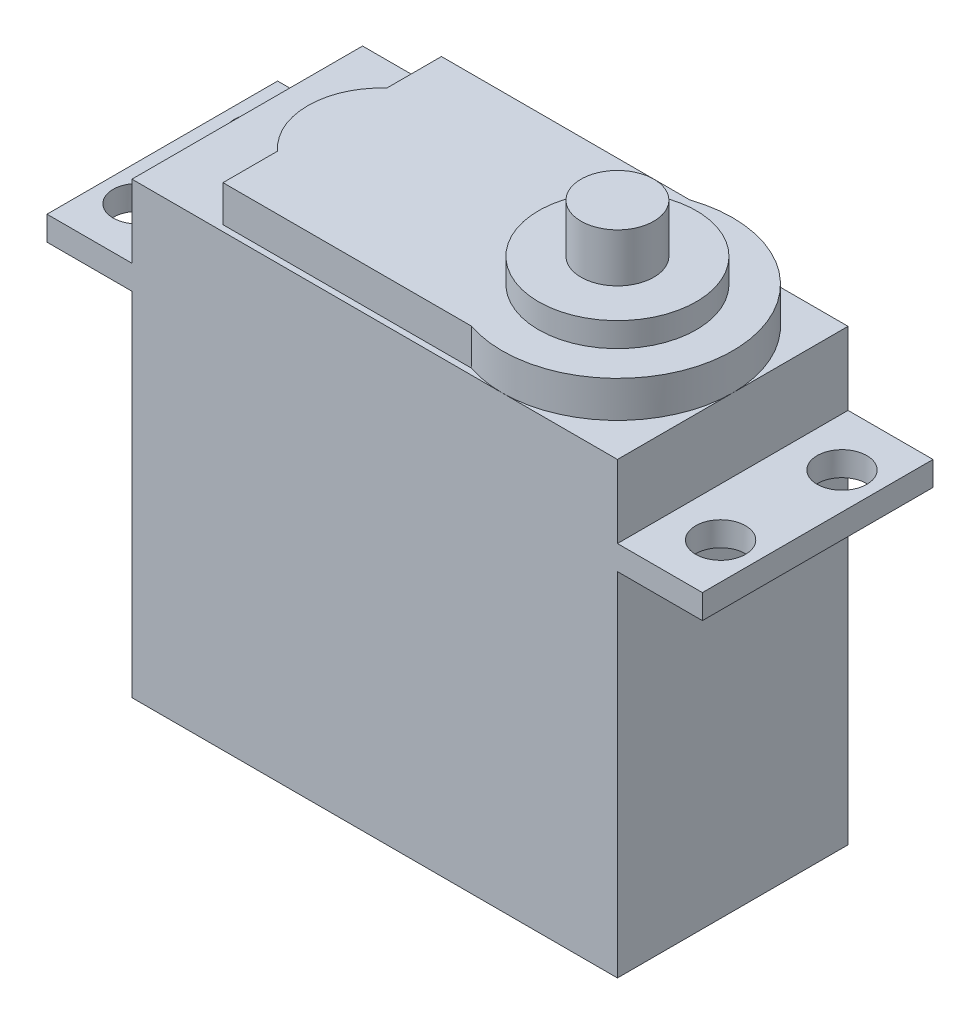
ISO-10303-21;
HEADER;
FILE_DESCRIPTION(('STEP AP214'),'2;1');
FILE_NAME('part.step','',(''),(''),'','','');
FILE_SCHEMA(('AUTOMOTIVE_DESIGN { 1 0 10303 214 1 1 1 1 }'));
ENDSEC;
DATA;
#1=APPLICATION_CONTEXT('core data for automotive mechanical design processes');
#2=APPLICATION_PROTOCOL_DEFINITION('international standard','automotive_design',2000,#1);
#3=PRODUCT_CONTEXT('',#1,'mechanical');
#4=PRODUCT('Part','Part','',(#3));
#5=PRODUCT_RELATED_PRODUCT_CATEGORY('part','',(#4));
#6=PRODUCT_DEFINITION_FORMATION('','',#4);
#7=PRODUCT_DEFINITION_CONTEXT('part definition',#1,'design');
#8=PRODUCT_DEFINITION('design','',#6,#7);
#9=PRODUCT_DEFINITION_SHAPE('','',#8);
#10=(LENGTH_UNIT() NAMED_UNIT(*) SI_UNIT(.MILLI.,.METRE.));
#11=(NAMED_UNIT(*) PLANE_ANGLE_UNIT() SI_UNIT($,.RADIAN.));
#12=(NAMED_UNIT(*) SI_UNIT($,.STERADIAN.) SOLID_ANGLE_UNIT());
#13=UNCERTAINTY_MEASURE_WITH_UNIT(LENGTH_MEASURE(1.E-05),#10,'distance_accuracy_value','');
#14=(GEOMETRIC_REPRESENTATION_CONTEXT(3) GLOBAL_UNCERTAINTY_ASSIGNED_CONTEXT((#13)) GLOBAL_UNIT_ASSIGNED_CONTEXT((#10,
#11,#12)) REPRESENTATION_CONTEXT('',''));
#15=CARTESIAN_POINT('',(0.,0.,0.));
#16=DIRECTION('',(0.,0.,1.));
#17=DIRECTION('',(1.,0.,0.));
#18=AXIS2_PLACEMENT_3D('',#15,#16,#17);
#19=CARTESIAN_POINT('',(0.,0.,19.));
#20=DIRECTION('',(1.,0.,0.));
#21=DIRECTION('',(0.,0.,-1.));
#22=AXIS2_PLACEMENT_3D('',#19,#20,#21);
#23=PLANE('',#22);
#24=DIRECTION('',(0.,0.,-1.));
#25=VECTOR('',#24,1.);
#26=CARTESIAN_POINT('',(0.,30.999999912,19.));
#27=LINE('',#26,#25);
#28=CARTESIAN_POINT('',(0.,30.999999912,19.));
#29=VERTEX_POINT('',#28);
#30=CARTESIAN_POINT('',(0.,30.999999912,0.));
#31=VERTEX_POINT('',#30);
#32=EDGE_CURVE('E189',#29,#31,#27,.T.);
#33=ORIENTED_EDGE('',*,*,#32,.F.);
#34=DIRECTION('',(0.,-1.,0.));
#35=VECTOR('',#34,1.);
#36=CARTESIAN_POINT('',(0.,0.,19.));
#37=LINE('',#36,#35);
#38=CARTESIAN_POINT('',(0.,37.,19.));
#39=VERTEX_POINT('',#38);
#40=EDGE_CURVE('E287',#39,#29,#37,.T.);
#41=ORIENTED_EDGE('',*,*,#40,.F.);
#42=DIRECTION('',(0.,0.,-1.));
#43=VECTOR('',#42,1.);
#44=CARTESIAN_POINT('',(0.,37.,19.));
#45=LINE('',#44,#43);
#46=CARTESIAN_POINT('',(0.,37.,0.));
#47=VERTEX_POINT('',#46);
#48=EDGE_CURVE('E301',#39,#47,#45,.T.);
#49=ORIENTED_EDGE('',*,*,#48,.T.);
#50=DIRECTION('',(0.,-1.,0.));
#51=VECTOR('',#50,1.);
#52=CARTESIAN_POINT('',(0.,0.,0.));
#53=LINE('',#52,#51);
#54=EDGE_CURVE('E302',#47,#31,#53,.T.);
#55=ORIENTED_EDGE('',*,*,#54,.T.);
#56=EDGE_LOOP('',(#33,#41,#49,#55));
#57=FACE_BOUND('',#56,.T.);
#58=ADVANCED_FACE('F34',(#57),#23,.F.);
#59=CARTESIAN_POINT('',(40.,0.,19.));
#60=DIRECTION('',(-1.,0.,0.));
#61=DIRECTION('',(0.,0.,1.));
#62=AXIS2_PLACEMENT_3D('',#59,#60,#61);
#63=PLANE('',#62);
#64=DIRECTION('',(0.,0.,1.));
#65=VECTOR('',#64,1.);
#66=CARTESIAN_POINT('',(40.,30.999999912,19.));
#67=LINE('',#66,#65);
#68=CARTESIAN_POINT('',(40.,30.999999912,0.));
#69=VERTEX_POINT('',#68);
#70=CARTESIAN_POINT('',(40.,30.999999912,19.));
#71=VERTEX_POINT('',#70);
#72=EDGE_CURVE('E224',#69,#71,#67,.T.);
#73=ORIENTED_EDGE('',*,*,#72,.F.);
#74=DIRECTION('',(0.,1.,0.));
#75=VECTOR('',#74,1.);
#76=CARTESIAN_POINT('',(40.,0.,0.));
#77=LINE('',#76,#75);
#78=CARTESIAN_POINT('',(40.,37.,0.));
#79=VERTEX_POINT('',#78);
#80=EDGE_CURVE('E306',#69,#79,#77,.T.);
#81=ORIENTED_EDGE('',*,*,#80,.T.);
#82=DIRECTION('',(0.,0.,-1.));
#83=VECTOR('',#82,1.);
#84=CARTESIAN_POINT('',(40.,37.,19.));
#85=LINE('',#84,#83);
#86=CARTESIAN_POINT('',(40.,37.,9.5));
#87=VERTEX_POINT('',#86);
#88=EDGE_CURVE('E316',#87,#79,#85,.T.);
#89=ORIENTED_EDGE('',*,*,#88,.F.);
#90=CARTESIAN_POINT('',(40.,37.,19.));
#91=VERTEX_POINT('',#90);
#92=EDGE_CURVE('E317',#91,#87,#85,.T.);
#93=ORIENTED_EDGE('',*,*,#92,.F.);
#94=DIRECTION('',(0.,1.,0.));
#95=VECTOR('',#94,1.);
#96=CARTESIAN_POINT('',(40.,0.,19.));
#97=LINE('',#96,#95);
#98=EDGE_CURVE('E293',#71,#91,#97,.T.);
#99=ORIENTED_EDGE('',*,*,#98,.F.);
#100=EDGE_LOOP('',(#73,#81,#89,#93,#99));
#101=FACE_BOUND('',#100,.T.);
#102=ADVANCED_FACE('F373',(#101),#63,.F.);
#103=CARTESIAN_POINT('',(0.,37.,19.));
#104=DIRECTION('',(0.,-1.,0.));
#105=DIRECTION('',(0.,0.,-1.));
#106=AXIS2_PLACEMENT_3D('',#103,#104,#105);
#107=PLANE('',#106);
#108=CARTESIAN_POINT('',(30.5,37.,9.5));
#109=DIRECTION('',(0.,1.,0.));
#110=DIRECTION('',(0.,0.,1.));
#111=AXIS2_PLACEMENT_3D('',#108,#109,#110);
#112=CIRCLE('',#111,9.5);
#113=CARTESIAN_POINT('',(30.5,37.,0.));
#114=VERTEX_POINT('',#113);
#115=CARTESIAN_POINT('',(27.4586187348509,37.,0.500000000000002));
#116=VERTEX_POINT('',#115);
#117=EDGE_CURVE('E43',#114,#116,#112,.T.);
#118=ORIENTED_EDGE('',*,*,#117,.F.);
#119=DIRECTION('',(-1.,0.,0.));
#120=VECTOR('',#119,1.);
#121=CARTESIAN_POINT('',(0.,37.,0.));
#122=LINE('',#121,#120);
#123=EDGE_CURVE('E310',#114,#47,#122,.T.);
#124=ORIENTED_EDGE('',*,*,#123,.T.);
#125=ORIENTED_EDGE('',*,*,#48,.F.);
#126=DIRECTION('',(-1.,0.,0.));
#127=VECTOR('',#126,1.);
#128=CARTESIAN_POINT('',(0.,37.,19.));
#129=LINE('',#128,#127);
#130=CARTESIAN_POINT('',(30.5,37.,19.));
#131=VERTEX_POINT('',#130);
#132=EDGE_CURVE('E297',#131,#39,#129,.T.);
#133=ORIENTED_EDGE('',*,*,#132,.F.);
#134=CARTESIAN_POINT('',(27.4586187348509,37.,18.5));
#135=VERTEX_POINT('',#134);
#136=EDGE_CURVE('E260',#135,#131,#112,.T.);
#137=ORIENTED_EDGE('',*,*,#136,.F.);
#138=DIRECTION('',(1.,0.,0.));
#139=VECTOR('',#138,1.);
#140=CARTESIAN_POINT('',(7.,37.,18.5));
#141=LINE('',#140,#139);
#142=CARTESIAN_POINT('',(7.,37.,18.5));
#143=VERTEX_POINT('',#142);
#144=EDGE_CURVE('E257',#143,#135,#141,.T.);
#145=ORIENTED_EDGE('',*,*,#144,.F.);
#146=DIRECTION('',(0.,0.,1.));
#147=VECTOR('',#146,1.);
#148=CARTESIAN_POINT('',(7.,37.,14.));
#149=LINE('',#148,#147);
#150=CARTESIAN_POINT('',(7.,37.,14.));
#151=VERTEX_POINT('',#150);
#152=EDGE_CURVE('E254',#151,#143,#149,.T.);
#153=ORIENTED_EDGE('',*,*,#152,.F.);
#154=CARTESIAN_POINT('',(11.0625,37.,9.5));
#155=DIRECTION('',(0.,1.,0.));
#156=DIRECTION('',(0.,0.,1.));
#157=AXIS2_PLACEMENT_3D('',#154,#155,#156);
#158=CIRCLE('',#157,6.0625);
#159=CARTESIAN_POINT('',(7.,37.,5.));
#160=VERTEX_POINT('',#159);
#161=EDGE_CURVE('E234',#160,#151,#158,.T.);
#162=ORIENTED_EDGE('',*,*,#161,.F.);
#163=DIRECTION('',(0.,0.,1.));
#164=VECTOR('',#163,1.);
#165=CARTESIAN_POINT('',(7.,37.,0.5));
#166=LINE('',#165,#164);
#167=CARTESIAN_POINT('',(7.,37.,0.5));
#168=VERTEX_POINT('',#167);
#169=EDGE_CURVE('E241',#168,#160,#166,.T.);
#170=ORIENTED_EDGE('',*,*,#169,.F.);
#171=DIRECTION('',(-1.,0.,0.));
#172=VECTOR('',#171,1.);
#173=CARTESIAN_POINT('',(7.,37.,0.5));
#174=LINE('',#173,#172);
#175=EDGE_CURVE('E263',#116,#168,#174,.T.);
#176=ORIENTED_EDGE('',*,*,#175,.F.);
#177=EDGE_LOOP('',(#118,#124,#125,#133,#137,#145,#153,#162,#170,#176));
#178=FACE_BOUND('',#177,.T.);
#179=ADVANCED_FACE('F352',(#178),#107,.F.);
#180=EDGE_CURVE('E330',#87,#114,#112,.T.);
#181=ORIENTED_EDGE('',*,*,#180,.F.);
#182=ORIENTED_EDGE('',*,*,#88,.T.);
#183=EDGE_CURVE('E311',#79,#114,#122,.T.);
#184=ORIENTED_EDGE('',*,*,#183,.T.);
#185=EDGE_LOOP('',(#181,#182,#184));
#186=FACE_BOUND('',#185,.T.);
#187=ADVANCED_FACE('F389',(#186),#107,.F.);
#188=EDGE_CURVE('E264',#131,#87,#112,.T.);
#189=ORIENTED_EDGE('',*,*,#188,.F.);
#190=EDGE_CURVE('E298',#91,#131,#129,.T.);
#191=ORIENTED_EDGE('',*,*,#190,.F.);
#192=ORIENTED_EDGE('',*,*,#92,.T.);
#193=EDGE_LOOP('',(#189,#191,#192));
#194=FACE_BOUND('',#193,.T.);
#195=ADVANCED_FACE('F383',(#194),#107,.F.);
#196=CARTESIAN_POINT('',(0.,28.999999912,19.));
#197=VERTEX_POINT('',#196);
#198=CARTESIAN_POINT('',(0.,0.,19.));
#199=VERTEX_POINT('',#198);
#200=EDGE_CURVE('E291',#197,#199,#37,.T.);
#201=ORIENTED_EDGE('',*,*,#200,.F.);
#202=DIRECTION('',(0.,0.,-1.));
#203=VECTOR('',#202,1.);
#204=CARTESIAN_POINT('',(0.,28.999999912,19.));
#205=LINE('',#204,#203);
#206=CARTESIAN_POINT('',(0.,28.999999912,0.));
#207=VERTEX_POINT('',#206);
#208=EDGE_CURVE('E222',#197,#207,#205,.T.);
#209=ORIENTED_EDGE('',*,*,#208,.T.);
#210=CARTESIAN_POINT('',(0.,0.,0.));
#211=VERTEX_POINT('',#210);
#212=EDGE_CURVE('E286',#207,#211,#53,.T.);
#213=ORIENTED_EDGE('',*,*,#212,.T.);
#214=DIRECTION('',(0.,0.,-1.));
#215=VECTOR('',#214,1.);
#216=CARTESIAN_POINT('',(0.,0.,19.));
#217=LINE('',#216,#215);
#218=EDGE_CURVE('E38',#199,#211,#217,.T.);
#219=ORIENTED_EDGE('',*,*,#218,.F.);
#220=EDGE_LOOP('',(#201,#209,#213,#219));
#221=FACE_BOUND('',#220,.T.);
#222=ADVANCED_FACE('F36',(#221),#23,.F.);
#223=CARTESIAN_POINT('',(0.,0.,19.));
#224=DIRECTION('',(0.,1.,0.));
#225=DIRECTION('',(0.,0.,1.));
#226=AXIS2_PLACEMENT_3D('',#223,#224,#225);
#227=PLANE('',#226);
#228=DIRECTION('',(1.,0.,0.));
#229=VECTOR('',#228,1.);
#230=CARTESIAN_POINT('',(0.,0.,0.));
#231=LINE('',#230,#229);
#232=CARTESIAN_POINT('',(40.,0.,0.));
#233=VERTEX_POINT('',#232);
#234=EDGE_CURVE('E304',#211,#233,#231,.T.);
#235=ORIENTED_EDGE('',*,*,#234,.T.);
#236=DIRECTION('',(0.,0.,-1.));
#237=VECTOR('',#236,1.);
#238=CARTESIAN_POINT('',(40.,0.,19.));
#239=LINE('',#238,#237);
#240=CARTESIAN_POINT('',(40.,0.,19.));
#241=VERTEX_POINT('',#240);
#242=EDGE_CURVE('E319',#241,#233,#239,.T.);
#243=ORIENTED_EDGE('',*,*,#242,.F.);
#244=DIRECTION('',(1.,0.,0.));
#245=VECTOR('',#244,1.);
#246=CARTESIAN_POINT('',(0.,0.,19.));
#247=LINE('',#246,#245);
#248=EDGE_CURVE('E290',#199,#241,#247,.T.);
#249=ORIENTED_EDGE('',*,*,#248,.F.);
#250=ORIENTED_EDGE('',*,*,#218,.T.);
#251=EDGE_LOOP('',(#235,#243,#249,#250));
#252=FACE_BOUND('',#251,.T.);
#253=ADVANCED_FACE('F382',(#252),#227,.F.);
#254=CARTESIAN_POINT('',(40.,28.999999912,0.));
#255=VERTEX_POINT('',#254);
#256=EDGE_CURVE('E307',#233,#255,#77,.T.);
#257=ORIENTED_EDGE('',*,*,#256,.T.);
#258=DIRECTION('',(0.,0.,1.));
#259=VECTOR('',#258,1.);
#260=CARTESIAN_POINT('',(40.,28.999999912,19.));
#261=LINE('',#260,#259);
#262=CARTESIAN_POINT('',(40.,28.999999912,19.));
#263=VERTEX_POINT('',#262);
#264=EDGE_CURVE('E216',#255,#263,#261,.T.);
#265=ORIENTED_EDGE('',*,*,#264,.T.);
#266=EDGE_CURVE('E294',#241,#263,#97,.T.);
#267=ORIENTED_EDGE('',*,*,#266,.F.);
#268=ORIENTED_EDGE('',*,*,#242,.T.);
#269=EDGE_LOOP('',(#257,#265,#267,#268));
#270=FACE_BOUND('',#269,.T.);
#271=ADVANCED_FACE('F380',(#270),#63,.F.);
#272=CARTESIAN_POINT('',(0.,0.,19.));
#273=DIRECTION('',(0.,0.,-1.));
#274=DIRECTION('',(-1.,0.,0.));
#275=AXIS2_PLACEMENT_3D('',#272,#273,#274);
#276=PLANE('',#275);
#277=ORIENTED_EDGE('',*,*,#266,.T.);
#278=DIRECTION('',(-1.,0.,0.));
#279=VECTOR('',#278,1.);
#280=CARTESIAN_POINT('',(-7.,28.999999912,19.));
#281=LINE('',#280,#279);
#282=CARTESIAN_POINT('',(47.,28.999999912,19.));
#283=VERTEX_POINT('',#282);
#284=EDGE_CURVE('E51',#283,#263,#281,.T.);
#285=ORIENTED_EDGE('',*,*,#284,.F.);
#286=DIRECTION('',(0.,-1.,0.));
#287=VECTOR('',#286,1.);
#288=CARTESIAN_POINT('',(47.,30.999999912,19.));
#289=LINE('',#288,#287);
#290=CARTESIAN_POINT('',(47.,30.999999912,19.));
#291=VERTEX_POINT('',#290);
#292=EDGE_CURVE('E217',#291,#283,#289,.T.);
#293=ORIENTED_EDGE('',*,*,#292,.F.);
#294=DIRECTION('',(-1.,0.,0.));
#295=VECTOR('',#294,1.);
#296=CARTESIAN_POINT('',(-7.,30.999999912,19.));
#297=LINE('',#296,#295);
#298=EDGE_CURVE('E182',#291,#71,#297,.T.);
#299=ORIENTED_EDGE('',*,*,#298,.T.);
#300=ORIENTED_EDGE('',*,*,#98,.T.);
#301=ORIENTED_EDGE('',*,*,#190,.T.);
#302=ORIENTED_EDGE('',*,*,#132,.T.);
#303=ORIENTED_EDGE('',*,*,#40,.T.);
#304=CARTESIAN_POINT('',(-7.,30.999999912,19.));
#305=VERTEX_POINT('',#304);
#306=EDGE_CURVE('E206',#29,#305,#297,.T.);
#307=ORIENTED_EDGE('',*,*,#306,.T.);
#308=DIRECTION('',(0.,-1.,0.));
#309=VECTOR('',#308,1.);
#310=CARTESIAN_POINT('',(-7.,30.999999912,19.));
#311=LINE('',#310,#309);
#312=CARTESIAN_POINT('',(-7.,28.999999912,19.));
#313=VERTEX_POINT('',#312);
#314=EDGE_CURVE('E196',#305,#313,#311,.T.);
#315=ORIENTED_EDGE('',*,*,#314,.T.);
#316=EDGE_CURVE('E198',#197,#313,#281,.T.);
#317=ORIENTED_EDGE('',*,*,#316,.F.);
#318=ORIENTED_EDGE('',*,*,#200,.T.);
#319=ORIENTED_EDGE('',*,*,#248,.T.);
#320=EDGE_LOOP('',(#277,#285,#293,#299,#300,#301,#302,#303,#307,#315,#317,#318,#319));
#321=FACE_BOUND('',#320,.T.);
#322=ADVANCED_FACE('F395',(#321),#276,.F.);
#323=CARTESIAN_POINT('',(0.,0.,0.));
#324=DIRECTION('',(0.,0.,-1.));
#325=DIRECTION('',(-1.,0.,0.));
#326=AXIS2_PLACEMENT_3D('',#323,#324,#325);
#327=PLANE('',#326);
#328=ORIENTED_EDGE('',*,*,#212,.F.);
#329=DIRECTION('',(1.,0.,0.));
#330=VECTOR('',#329,1.);
#331=CARTESIAN_POINT('',(-7.,28.999999912,0.));
#332=LINE('',#331,#330);
#333=CARTESIAN_POINT('',(-7.,28.999999912,0.));
#334=VERTEX_POINT('',#333);
#335=EDGE_CURVE('E59',#334,#207,#332,.T.);
#336=ORIENTED_EDGE('',*,*,#335,.F.);
#337=DIRECTION('',(0.,-1.,0.));
#338=VECTOR('',#337,1.);
#339=CARTESIAN_POINT('',(-7.,30.999999912,0.));
#340=LINE('',#339,#338);
#341=CARTESIAN_POINT('',(-7.,30.999999912,0.));
#342=VERTEX_POINT('',#341);
#343=EDGE_CURVE('E171',#342,#334,#340,.T.);
#344=ORIENTED_EDGE('',*,*,#343,.F.);
#345=DIRECTION('',(1.,0.,0.));
#346=VECTOR('',#345,1.);
#347=CARTESIAN_POINT('',(-7.,30.999999912,0.));
#348=LINE('',#347,#346);
#349=EDGE_CURVE('E176',#342,#31,#348,.T.);
#350=ORIENTED_EDGE('',*,*,#349,.T.);
#351=ORIENTED_EDGE('',*,*,#54,.F.);
#352=ORIENTED_EDGE('',*,*,#123,.F.);
#353=ORIENTED_EDGE('',*,*,#183,.F.);
#354=ORIENTED_EDGE('',*,*,#80,.F.);
#355=CARTESIAN_POINT('',(47.,30.999999912,0.));
#356=VERTEX_POINT('',#355);
#357=EDGE_CURVE('E191',#69,#356,#348,.T.);
#358=ORIENTED_EDGE('',*,*,#357,.T.);
#359=DIRECTION('',(0.,-1.,0.));
#360=VECTOR('',#359,1.);
#361=CARTESIAN_POINT('',(47.,30.999999912,0.));
#362=LINE('',#361,#360);
#363=CARTESIAN_POINT('',(47.,28.999999912,0.));
#364=VERTEX_POINT('',#363);
#365=EDGE_CURVE('E181',#356,#364,#362,.T.);
#366=ORIENTED_EDGE('',*,*,#365,.T.);
#367=EDGE_CURVE('E211',#255,#364,#332,.T.);
#368=ORIENTED_EDGE('',*,*,#367,.F.);
#369=ORIENTED_EDGE('',*,*,#256,.F.);
#370=ORIENTED_EDGE('',*,*,#234,.F.);
#371=EDGE_LOOP('',(#328,#336,#344,#350,#351,#352,#353,#354,#358,#366,#368,#369,#370));
#372=FACE_BOUND('',#371,.T.);
#373=ADVANCED_FACE('F174',(#372),#327,.T.);
#374=CARTESIAN_POINT('',(11.0625,40.,9.5));
#375=DIRECTION('',(0.,-1.,0.));
#376=DIRECTION('',(0.,0.,-1.));
#377=AXIS2_PLACEMENT_3D('',#374,#375,#376);
#378=CYLINDRICAL_SURFACE('',#377,6.0625);
#379=ORIENTED_EDGE('',*,*,#161,.T.);
#380=DIRECTION('',(0.,-1.,0.));
#381=VECTOR('',#380,1.);
#382=CARTESIAN_POINT('',(7.,40.,14.));
#383=LINE('',#382,#381);
#384=CARTESIAN_POINT('',(7.,40.,14.));
#385=VERTEX_POINT('',#384);
#386=EDGE_CURVE('E283',#385,#151,#383,.T.);
#387=ORIENTED_EDGE('',*,*,#386,.F.);
#388=CARTESIAN_POINT('',(11.0625,40.,9.5));
#389=DIRECTION('',(0.,1.,0.));
#390=DIRECTION('',(0.,0.,1.));
#391=AXIS2_PLACEMENT_3D('',#388,#389,#390);
#392=CIRCLE('',#391,6.0625);
#393=CARTESIAN_POINT('',(7.,40.,5.));
#394=VERTEX_POINT('',#393);
#395=EDGE_CURVE('E237',#394,#385,#392,.T.);
#396=ORIENTED_EDGE('',*,*,#395,.F.);
#397=DIRECTION('',(0.,-1.,0.));
#398=VECTOR('',#397,1.);
#399=CARTESIAN_POINT('',(7.,40.,5.));
#400=LINE('',#399,#398);
#401=EDGE_CURVE('E251',#394,#160,#400,.T.);
#402=ORIENTED_EDGE('',*,*,#401,.T.);
#403=EDGE_LOOP('',(#379,#387,#396,#402));
#404=FACE_BOUND('',#403,.T.);
#405=ADVANCED_FACE('F359',(#404),#378,.T.);
#406=CARTESIAN_POINT('',(7.,40.,14.));
#407=DIRECTION('',(1.,0.,0.));
#408=DIRECTION('',(0.,0.,-1.));
#409=AXIS2_PLACEMENT_3D('',#406,#407,#408);
#410=PLANE('',#409);
#411=ORIENTED_EDGE('',*,*,#152,.T.);
#412=DIRECTION('',(0.,-1.,0.));
#413=VECTOR('',#412,1.);
#414=CARTESIAN_POINT('',(7.,40.,18.5));
#415=LINE('',#414,#413);
#416=CARTESIAN_POINT('',(7.,40.,18.5));
#417=VERTEX_POINT('',#416);
#418=EDGE_CURVE('E280',#417,#143,#415,.T.);
#419=ORIENTED_EDGE('',*,*,#418,.F.);
#420=DIRECTION('',(0.,0.,1.));
#421=VECTOR('',#420,1.);
#422=CARTESIAN_POINT('',(7.,40.,14.));
#423=LINE('',#422,#421);
#424=EDGE_CURVE('E240',#385,#417,#423,.T.);
#425=ORIENTED_EDGE('',*,*,#424,.F.);
#426=ORIENTED_EDGE('',*,*,#386,.T.);
#427=EDGE_LOOP('',(#411,#419,#425,#426));
#428=FACE_BOUND('',#427,.T.);
#429=ADVANCED_FACE('F355',(#428),#410,.F.);
#430=CARTESIAN_POINT('',(7.,40.,18.5));
#431=DIRECTION('',(0.,0.,-1.));
#432=DIRECTION('',(-1.,0.,0.));
#433=AXIS2_PLACEMENT_3D('',#430,#431,#432);
#434=PLANE('',#433);
#435=ORIENTED_EDGE('',*,*,#144,.T.);
#436=DIRECTION('',(0.,-1.,0.));
#437=VECTOR('',#436,1.);
#438=CARTESIAN_POINT('',(27.4586187348509,40.,18.5));
#439=LINE('',#438,#437);
#440=CARTESIAN_POINT('',(27.4586187348509,40.,18.5));
#441=VERTEX_POINT('',#440);
#442=EDGE_CURVE('E277',#441,#135,#439,.T.);
#443=ORIENTED_EDGE('',*,*,#442,.F.);
#444=DIRECTION('',(1.,0.,0.));
#445=VECTOR('',#444,1.);
#446=CARTESIAN_POINT('',(7.,40.,18.5));
#447=LINE('',#446,#445);
#448=EDGE_CURVE('E243',#417,#441,#447,.T.);
#449=ORIENTED_EDGE('',*,*,#448,.F.);
#450=ORIENTED_EDGE('',*,*,#418,.T.);
#451=EDGE_LOOP('',(#435,#443,#449,#450));
#452=FACE_BOUND('',#451,.T.);
#453=ADVANCED_FACE('F350',(#452),#434,.F.);
#454=CARTESIAN_POINT('',(30.5,40.,9.5));
#455=DIRECTION('',(0.,-1.,0.));
#456=DIRECTION('',(0.,0.,-1.));
#457=AXIS2_PLACEMENT_3D('',#454,#455,#456);
#458=CYLINDRICAL_SURFACE('',#457,9.5);
#459=ORIENTED_EDGE('',*,*,#136,.T.);
#460=ORIENTED_EDGE('',*,*,#188,.T.);
#461=ORIENTED_EDGE('',*,*,#180,.T.);
#462=ORIENTED_EDGE('',*,*,#117,.T.);
#463=DIRECTION('',(0.,-1.,0.));
#464=VECTOR('',#463,1.);
#465=CARTESIAN_POINT('',(27.4586187348509,40.,0.500000000000002));
#466=LINE('',#465,#464);
#467=CARTESIAN_POINT('',(27.4586187348509,40.,0.500000000000002));
#468=VERTEX_POINT('',#467);
#469=EDGE_CURVE('E274',#468,#116,#466,.T.);
#470=ORIENTED_EDGE('',*,*,#469,.F.);
#471=CARTESIAN_POINT('',(30.5,40.,9.5));
#472=DIRECTION('',(0.,1.,0.));
#473=DIRECTION('',(0.,0.,1.));
#474=AXIS2_PLACEMENT_3D('',#471,#472,#473);
#475=CIRCLE('',#474,9.5);
#476=EDGE_CURVE('E245',#441,#468,#475,.T.);
#477=ORIENTED_EDGE('',*,*,#476,.F.);
#478=ORIENTED_EDGE('',*,*,#442,.T.);
#479=EDGE_LOOP('',(#459,#460,#461,#462,#470,#477,#478));
#480=FACE_BOUND('',#479,.T.);
#481=ADVANCED_FACE('F335',(#480),#458,.T.);
#482=CARTESIAN_POINT('',(7.,40.,0.5));
#483=DIRECTION('',(0.,0.,1.));
#484=DIRECTION('',(1.,0.,0.));
#485=AXIS2_PLACEMENT_3D('',#482,#483,#484);
#486=PLANE('',#485);
#487=ORIENTED_EDGE('',*,*,#175,.T.);
#488=DIRECTION('',(0.,-1.,0.));
#489=VECTOR('',#488,1.);
#490=CARTESIAN_POINT('',(7.,40.,0.5));
#491=LINE('',#490,#489);
#492=CARTESIAN_POINT('',(7.,40.,0.5));
#493=VERTEX_POINT('',#492);
#494=EDGE_CURVE('E271',#493,#168,#491,.T.);
#495=ORIENTED_EDGE('',*,*,#494,.F.);
#496=DIRECTION('',(-1.,0.,0.));
#497=VECTOR('',#496,1.);
#498=CARTESIAN_POINT('',(7.,40.,0.5));
#499=LINE('',#498,#497);
#500=EDGE_CURVE('E247',#468,#493,#499,.T.);
#501=ORIENTED_EDGE('',*,*,#500,.F.);
#502=ORIENTED_EDGE('',*,*,#469,.T.);
#503=EDGE_LOOP('',(#487,#495,#501,#502));
#504=FACE_BOUND('',#503,.T.);
#505=ADVANCED_FACE('F341',(#504),#486,.F.);
#506=CARTESIAN_POINT('',(7.,40.,0.5));
#507=DIRECTION('',(1.,0.,0.));
#508=DIRECTION('',(0.,0.,-1.));
#509=AXIS2_PLACEMENT_3D('',#506,#507,#508);
#510=PLANE('',#509);
#511=ORIENTED_EDGE('',*,*,#169,.T.);
#512=ORIENTED_EDGE('',*,*,#401,.F.);
#513=DIRECTION('',(0.,0.,1.));
#514=VECTOR('',#513,1.);
#515=CARTESIAN_POINT('',(7.,40.,0.5));
#516=LINE('',#515,#514);
#517=EDGE_CURVE('E249',#493,#394,#516,.T.);
#518=ORIENTED_EDGE('',*,*,#517,.F.);
#519=ORIENTED_EDGE('',*,*,#494,.T.);
#520=EDGE_LOOP('',(#511,#512,#518,#519));
#521=FACE_BOUND('',#520,.T.);
#522=ADVANCED_FACE('F361',(#521),#510,.F.);
#523=CARTESIAN_POINT('',(11.0625,40.,9.5));
#524=DIRECTION('',(0.,1.,0.));
#525=DIRECTION('',(0.,0.,1.));
#526=AXIS2_PLACEMENT_3D('',#523,#524,#525);
#527=PLANE('',#526);
#528=CARTESIAN_POINT('',(30.5,40.,9.5));
#529=DIRECTION('',(0.,1.,0.));
#530=DIRECTION('',(0.,0.,1.));
#531=AXIS2_PLACEMENT_3D('',#528,#529,#530);
#532=CIRCLE('',#531,6.5);
#533=CARTESIAN_POINT('',(30.5,40.,16.));
#534=VERTEX_POINT('',#533);
#535=EDGE_CURVE('E229',#534,#534,#532,.T.);
#536=ORIENTED_EDGE('',*,*,#535,.F.);
#537=EDGE_LOOP('',(#536));
#538=FACE_BOUND('',#537,.T.);
#539=ORIENTED_EDGE('',*,*,#395,.T.);
#540=ORIENTED_EDGE('',*,*,#424,.T.);
#541=ORIENTED_EDGE('',*,*,#448,.T.);
#542=ORIENTED_EDGE('',*,*,#476,.T.);
#543=ORIENTED_EDGE('',*,*,#500,.T.);
#544=ORIENTED_EDGE('',*,*,#517,.T.);
#545=EDGE_LOOP('',(#539,#540,#541,#542,#543,#544));
#546=FACE_BOUND('',#545,.T.);
#547=ADVANCED_FACE('F345',(#538,#546),#527,.T.);
#548=CARTESIAN_POINT('',(30.5,42.,9.5));
#549=DIRECTION('',(0.,-1.,0.));
#550=DIRECTION('',(0.,0.,-1.));
#551=AXIS2_PLACEMENT_3D('',#548,#549,#550);
#552=CYLINDRICAL_SURFACE('',#551,6.5);
#553=CARTESIAN_POINT('',(30.5,42.,9.5));
#554=DIRECTION('',(0.,1.,0.));
#555=DIRECTION('',(0.,0.,1.));
#556=AXIS2_PLACEMENT_3D('',#553,#554,#555);
#557=CIRCLE('',#556,6.5);
#558=CARTESIAN_POINT('',(30.5,42.,16.));
#559=VERTEX_POINT('',#558);
#560=EDGE_CURVE('E231',#559,#559,#557,.T.);
#561=ORIENTED_EDGE('',*,*,#560,.F.);
#562=EDGE_LOOP('',(#561));
#563=FACE_BOUND('',#562,.T.);
#564=ORIENTED_EDGE('',*,*,#535,.T.);
#565=EDGE_LOOP('',(#564));
#566=FACE_BOUND('',#565,.T.);
#567=ADVANCED_FACE('F368',(#563,#566),#552,.T.);
#568=CARTESIAN_POINT('',(30.5,42.,9.5));
#569=DIRECTION('',(0.,1.,0.));
#570=DIRECTION('',(0.,0.,1.));
#571=AXIS2_PLACEMENT_3D('',#568,#569,#570);
#572=PLANE('',#571);
#573=CARTESIAN_POINT('',(30.5,42.,9.5));
#574=DIRECTION('',(0.,1.,0.));
#575=DIRECTION('',(0.,0.,1.));
#576=AXIS2_PLACEMENT_3D('',#573,#574,#575);
#577=CIRCLE('',#576,3.);
#578=CARTESIAN_POINT('',(30.5,42.,12.5));
#579=VERTEX_POINT('',#578);
#580=EDGE_CURVE('E11',#579,#579,#577,.T.);
#581=ORIENTED_EDGE('',*,*,#580,.F.);
#582=EDGE_LOOP('',(#581));
#583=FACE_BOUND('',#582,.T.);
#584=ORIENTED_EDGE('',*,*,#560,.T.);
#585=EDGE_LOOP('',(#584));
#586=FACE_BOUND('',#585,.T.);
#587=ADVANCED_FACE('F585',(#583,#586),#572,.T.);
#588=CARTESIAN_POINT('',(30.5,46.,9.5));
#589=DIRECTION('',(0.,-1.,0.));
#590=DIRECTION('',(0.,0.,-1.));
#591=AXIS2_PLACEMENT_3D('',#588,#589,#590);
#592=CYLINDRICAL_SURFACE('',#591,3.);
#593=CARTESIAN_POINT('',(30.5,46.,9.5));
#594=DIRECTION('',(0.,1.,0.));
#595=DIRECTION('',(0.,0.,1.));
#596=AXIS2_PLACEMENT_3D('',#593,#594,#595);
#597=CIRCLE('',#596,3.);
#598=CARTESIAN_POINT('',(30.5,46.,12.5));
#599=VERTEX_POINT('',#598);
#600=EDGE_CURVE('E227',#599,#599,#597,.T.);
#601=ORIENTED_EDGE('',*,*,#600,.F.);
#602=EDGE_LOOP('',(#601));
#603=FACE_BOUND('',#602,.T.);
#604=ORIENTED_EDGE('',*,*,#580,.T.);
#605=EDGE_LOOP('',(#604));
#606=FACE_BOUND('',#605,.T.);
#607=ADVANCED_FACE('F575',(#603,#606),#592,.T.);
#608=CARTESIAN_POINT('',(30.5,46.,9.5));
#609=DIRECTION('',(0.,1.,0.));
#610=DIRECTION('',(0.,0.,1.));
#611=AXIS2_PLACEMENT_3D('',#608,#609,#610);
#612=PLANE('',#611);
#613=ORIENTED_EDGE('',*,*,#600,.T.);
#614=EDGE_LOOP('',(#613));
#615=FACE_BOUND('',#614,.T.);
#616=ADVANCED_FACE('F439',(#615),#612,.T.);
#617=CARTESIAN_POINT('',(47.,30.999999912,19.));
#618=DIRECTION('',(1.,0.,0.));
#619=DIRECTION('',(0.,0.,-1.));
#620=AXIS2_PLACEMENT_3D('',#617,#618,#619);
#621=PLANE('',#620);
#622=DIRECTION('',(0.,0.,1.));
#623=VECTOR('',#622,1.);
#624=CARTESIAN_POINT('',(47.,28.999999912,19.));
#625=LINE('',#624,#623);
#626=EDGE_CURVE('E213',#364,#283,#625,.T.);
#627=ORIENTED_EDGE('',*,*,#626,.F.);
#628=ORIENTED_EDGE('',*,*,#365,.F.);
#629=DIRECTION('',(0.,0.,1.));
#630=VECTOR('',#629,1.);
#631=CARTESIAN_POINT('',(47.,30.999999912,19.));
#632=LINE('',#631,#630);
#633=EDGE_CURVE('E190',#356,#291,#632,.T.);
#634=ORIENTED_EDGE('',*,*,#633,.T.);
#635=ORIENTED_EDGE('',*,*,#292,.T.);
#636=EDGE_LOOP('',(#627,#628,#634,#635));
#637=FACE_BOUND('',#636,.T.);
#638=ADVANCED_FACE('F403',(#637),#621,.T.);
#639=CARTESIAN_POINT('',(0.,28.999999912,0.));
#640=DIRECTION('',(0.,-1.,0.));
#641=DIRECTION('',(0.,0.,-1.));
#642=AXIS2_PLACEMENT_3D('',#639,#640,#641);
#643=PLANE('',#642);
#644=CARTESIAN_POINT('',(44.,28.999999912,4.5));
#645=DIRECTION('',(0.,-1.,0.));
#646=DIRECTION('',(0.,0.,-1.));
#647=AXIS2_PLACEMENT_3D('',#644,#645,#646);
#648=CIRCLE('',#647,2.04999999999999);
#649=CARTESIAN_POINT('',(44.,28.999999912,2.45000000000001));
#650=VERTEX_POINT('',#649);
#651=EDGE_CURVE('E443',#650,#650,#648,.F.);
#652=ORIENTED_EDGE('',*,*,#651,.T.);
#653=EDGE_LOOP('',(#652));
#654=FACE_BOUND('',#653,.T.);
#655=CARTESIAN_POINT('',(44.,28.999999912,14.5));
#656=DIRECTION('',(0.,-1.,0.));
#657=DIRECTION('',(0.,0.,-1.));
#658=AXIS2_PLACEMENT_3D('',#655,#656,#657);
#659=CIRCLE('',#658,2.04999999999999);
#660=CARTESIAN_POINT('',(44.,28.999999912,12.45));
#661=VERTEX_POINT('',#660);
#662=EDGE_CURVE('E446',#661,#661,#659,.F.);
#663=ORIENTED_EDGE('',*,*,#662,.T.);
#664=EDGE_LOOP('',(#663));
#665=FACE_BOUND('',#664,.T.);
#666=ORIENTED_EDGE('',*,*,#264,.F.);
#667=ORIENTED_EDGE('',*,*,#367,.T.);
#668=ORIENTED_EDGE('',*,*,#626,.T.);
#669=ORIENTED_EDGE('',*,*,#284,.T.);
#670=EDGE_LOOP('',(#666,#667,#668,#669));
#671=FACE_BOUND('',#670,.T.);
#672=ADVANCED_FACE('F420',(#654,#665,#671),#643,.T.);
#673=CARTESIAN_POINT('',(0.,30.999999912,0.));
#674=DIRECTION('',(0.,-1.,0.));
#675=DIRECTION('',(0.,0.,-1.));
#676=AXIS2_PLACEMENT_3D('',#673,#674,#675);
#677=PLANE('',#676);
#678=CARTESIAN_POINT('',(44.,30.999999912,4.5));
#679=DIRECTION('',(0.,1.,0.));
#680=DIRECTION('',(0.,0.,1.));
#681=AXIS2_PLACEMENT_3D('',#678,#679,#680);
#682=CIRCLE('',#681,2.04999999999999);
#683=CARTESIAN_POINT('',(44.,30.999999912,6.55));
#684=VERTEX_POINT('',#683);
#685=EDGE_CURVE('E449',#684,#684,#682,.T.);
#686=ORIENTED_EDGE('',*,*,#685,.F.);
#687=EDGE_LOOP('',(#686));
#688=FACE_BOUND('',#687,.T.);
#689=CARTESIAN_POINT('',(44.,30.999999912,14.5));
#690=DIRECTION('',(0.,1.,0.));
#691=DIRECTION('',(0.,0.,1.));
#692=AXIS2_PLACEMENT_3D('',#689,#690,#691);
#693=CIRCLE('',#692,2.04999999999999);
#694=CARTESIAN_POINT('',(44.,30.999999912,16.55));
#695=VERTEX_POINT('',#694);
#696=EDGE_CURVE('E450',#695,#695,#693,.T.);
#697=ORIENTED_EDGE('',*,*,#696,.F.);
#698=EDGE_LOOP('',(#697));
#699=FACE_BOUND('',#698,.T.);
#700=ORIENTED_EDGE('',*,*,#357,.F.);
#701=ORIENTED_EDGE('',*,*,#72,.T.);
#702=ORIENTED_EDGE('',*,*,#298,.F.);
#703=ORIENTED_EDGE('',*,*,#633,.F.);
#704=EDGE_LOOP('',(#700,#701,#702,#703));
#705=FACE_BOUND('',#704,.T.);
#706=ADVANCED_FACE('F405',(#688,#699,#705),#677,.F.);
#707=CARTESIAN_POINT('',(-4.,30.999999912,14.5));
#708=DIRECTION('',(0.,1.,0.));
#709=DIRECTION('',(0.,0.,1.));
#710=AXIS2_PLACEMENT_3D('',#707,#708,#709);
#711=CIRCLE('',#710,2.05);
#712=CARTESIAN_POINT('',(-4.,30.999999912,16.55));
#713=VERTEX_POINT('',#712);
#714=EDGE_CURVE('E457',#713,#713,#711,.T.);
#715=ORIENTED_EDGE('',*,*,#714,.F.);
#716=EDGE_LOOP('',(#715));
#717=FACE_BOUND('',#716,.T.);
#718=CARTESIAN_POINT('',(-4.,30.999999912,4.5));
#719=DIRECTION('',(0.,1.,0.));
#720=DIRECTION('',(0.,0.,1.));
#721=AXIS2_PLACEMENT_3D('',#718,#719,#720);
#722=CIRCLE('',#721,2.05);
#723=CARTESIAN_POINT('',(-4.,30.999999912,6.55));
#724=VERTEX_POINT('',#723);
#725=EDGE_CURVE('E461',#724,#724,#722,.T.);
#726=ORIENTED_EDGE('',*,*,#725,.F.);
#727=EDGE_LOOP('',(#726));
#728=FACE_BOUND('',#727,.T.);
#729=ORIENTED_EDGE('',*,*,#306,.F.);
#730=ORIENTED_EDGE('',*,*,#32,.T.);
#731=ORIENTED_EDGE('',*,*,#349,.F.);
#732=DIRECTION('',(0.,0.,-1.));
#733=VECTOR('',#732,1.);
#734=CARTESIAN_POINT('',(-7.,30.999999912,19.));
#735=LINE('',#734,#733);
#736=EDGE_CURVE('E187',#305,#342,#735,.T.);
#737=ORIENTED_EDGE('',*,*,#736,.F.);
#738=EDGE_LOOP('',(#729,#730,#731,#737));
#739=FACE_BOUND('',#738,.T.);
#740=ADVANCED_FACE('F186',(#717,#728,#739),#677,.F.);
#741=CARTESIAN_POINT('',(-4.,28.999999912,14.5));
#742=DIRECTION('',(0.,-1.,0.));
#743=DIRECTION('',(0.,0.,-1.));
#744=AXIS2_PLACEMENT_3D('',#741,#742,#743);
#745=CIRCLE('',#744,2.05);
#746=CARTESIAN_POINT('',(-4.,28.999999912,12.45));
#747=VERTEX_POINT('',#746);
#748=EDGE_CURVE('E460',#747,#747,#745,.F.);
#749=ORIENTED_EDGE('',*,*,#748,.T.);
#750=EDGE_LOOP('',(#749));
#751=FACE_BOUND('',#750,.T.);
#752=CARTESIAN_POINT('',(-4.,28.999999912,4.5));
#753=DIRECTION('',(0.,-1.,0.));
#754=DIRECTION('',(0.,0.,-1.));
#755=AXIS2_PLACEMENT_3D('',#752,#753,#754);
#756=CIRCLE('',#755,2.05);
#757=CARTESIAN_POINT('',(-4.,28.999999912,2.45));
#758=VERTEX_POINT('',#757);
#759=EDGE_CURVE('E201',#758,#758,#756,.F.);
#760=ORIENTED_EDGE('',*,*,#759,.T.);
#761=EDGE_LOOP('',(#760));
#762=FACE_BOUND('',#761,.T.);
#763=ORIENTED_EDGE('',*,*,#208,.F.);
#764=ORIENTED_EDGE('',*,*,#316,.T.);
#765=DIRECTION('',(0.,0.,-1.));
#766=VECTOR('',#765,1.);
#767=CARTESIAN_POINT('',(-7.,28.999999912,19.));
#768=LINE('',#767,#766);
#769=EDGE_CURVE('E209',#313,#334,#768,.T.);
#770=ORIENTED_EDGE('',*,*,#769,.T.);
#771=ORIENTED_EDGE('',*,*,#335,.T.);
#772=EDGE_LOOP('',(#763,#764,#770,#771));
#773=FACE_BOUND('',#772,.T.);
#774=ADVANCED_FACE('F416',(#751,#762,#773),#643,.T.);
#775=CARTESIAN_POINT('',(-7.,30.999999912,19.));
#776=DIRECTION('',(-1.,0.,0.));
#777=DIRECTION('',(0.,0.,1.));
#778=AXIS2_PLACEMENT_3D('',#775,#776,#777);
#779=PLANE('',#778);
#780=ORIENTED_EDGE('',*,*,#769,.F.);
#781=ORIENTED_EDGE('',*,*,#314,.F.);
#782=ORIENTED_EDGE('',*,*,#736,.T.);
#783=ORIENTED_EDGE('',*,*,#343,.T.);
#784=EDGE_LOOP('',(#780,#781,#782,#783));
#785=FACE_BOUND('',#784,.T.);
#786=ADVANCED_FACE('F194',(#785),#779,.T.);
#787=CARTESIAN_POINT('',(-4.,23.2017243062703,4.5));
#788=DIRECTION('',(0.,1.,0.));
#789=DIRECTION('',(0.,0.,1.));
#790=AXIS2_PLACEMENT_3D('',#787,#788,#789);
#791=CYLINDRICAL_SURFACE('',#790,2.05);
#792=ORIENTED_EDGE('',*,*,#725,.T.);
#793=EDGE_LOOP('',(#792));
#794=FACE_BOUND('',#793,.T.);
#795=ORIENTED_EDGE('',*,*,#759,.F.);
#796=EDGE_LOOP('',(#795));
#797=FACE_BOUND('',#796,.T.);
#798=ADVANCED_FACE('F425',(#794,#797),#791,.F.);
#799=CARTESIAN_POINT('',(-4.,23.2017243062703,14.5));
#800=DIRECTION('',(0.,1.,0.));
#801=DIRECTION('',(0.,0.,1.));
#802=AXIS2_PLACEMENT_3D('',#799,#800,#801);
#803=CYLINDRICAL_SURFACE('',#802,2.05);
#804=ORIENTED_EDGE('',*,*,#714,.T.);
#805=EDGE_LOOP('',(#804));
#806=FACE_BOUND('',#805,.T.);
#807=ORIENTED_EDGE('',*,*,#748,.F.);
#808=EDGE_LOOP('',(#807));
#809=FACE_BOUND('',#808,.T.);
#810=ADVANCED_FACE('F470',(#806,#809),#803,.F.);
#811=CARTESIAN_POINT('',(44.,23.2017243062703,14.5));
#812=DIRECTION('',(0.,1.,0.));
#813=DIRECTION('',(0.,0.,1.));
#814=AXIS2_PLACEMENT_3D('',#811,#812,#813);
#815=CYLINDRICAL_SURFACE('',#814,2.04999999999999);
#816=ORIENTED_EDGE('',*,*,#696,.T.);
#817=EDGE_LOOP('',(#816));
#818=FACE_BOUND('',#817,.T.);
#819=ORIENTED_EDGE('',*,*,#662,.F.);
#820=EDGE_LOOP('',(#819));
#821=FACE_BOUND('',#820,.T.);
#822=ADVANCED_FACE('F475',(#818,#821),#815,.F.);
#823=CARTESIAN_POINT('',(44.,23.2017243062703,4.5));
#824=DIRECTION('',(0.,1.,0.));
#825=DIRECTION('',(0.,0.,1.));
#826=AXIS2_PLACEMENT_3D('',#823,#824,#825);
#827=CYLINDRICAL_SURFACE('',#826,2.04999999999999);
#828=ORIENTED_EDGE('',*,*,#685,.T.);
#829=EDGE_LOOP('',(#828));
#830=FACE_BOUND('',#829,.T.);
#831=ORIENTED_EDGE('',*,*,#651,.F.);
#832=EDGE_LOOP('',(#831));
#833=FACE_BOUND('',#832,.T.);
#834=ADVANCED_FACE('F479',(#830,#833),#827,.F.);
#835=CLOSED_SHELL('',(#58,#102,#179,#187,#195,#222,#253,#271,#322,#373,#405,#429,#453,#481,#505,
#522,#547,#567,#587,#607,#616,#638,#672,#706,#740,#774,#786,#798,#810,#822,#834));
#836=MANIFOLD_SOLID_BREP('B2',#835);
#837=ADVANCED_BREP_SHAPE_REPRESENTATION('',(#18,#836),#14);
#838=SHAPE_DEFINITION_REPRESENTATION(#9,#837);
ENDSEC;
END-ISO-10303-21;
